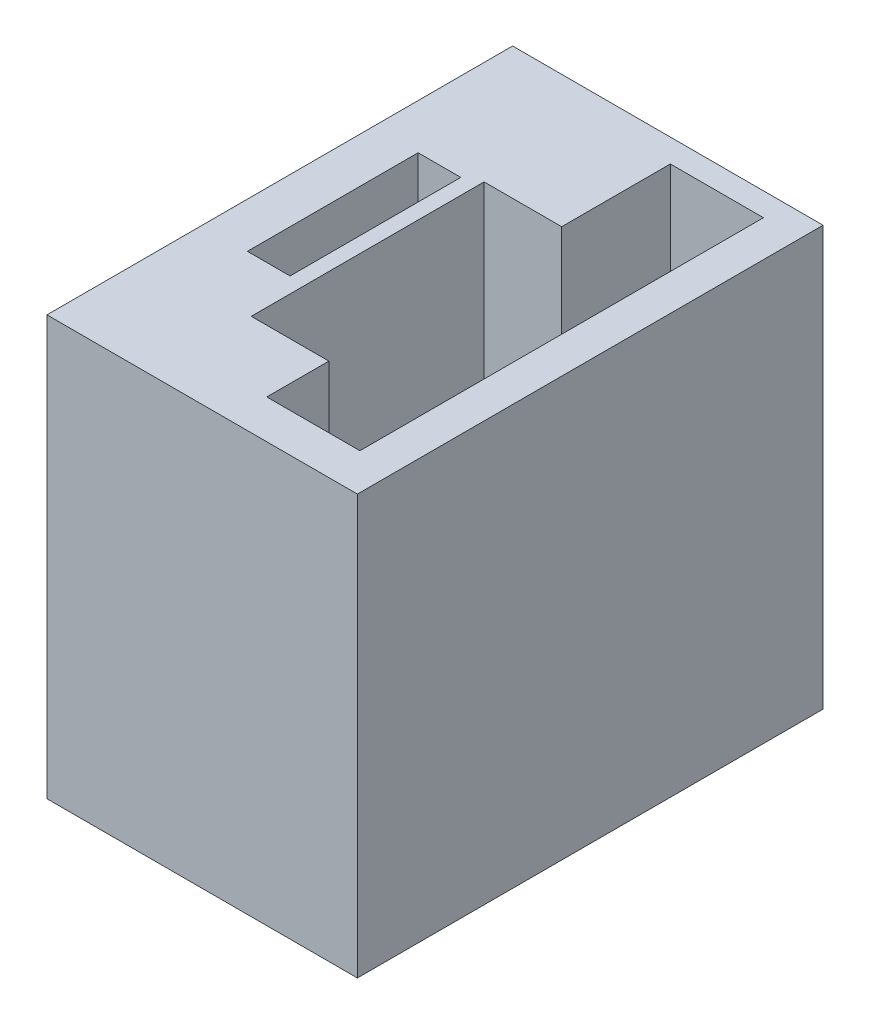
ISO-10303-21;
HEADER;
FILE_DESCRIPTION(('STEP AP214'),'2;1');
FILE_NAME('part.step','',(''),(''),'','','');
FILE_SCHEMA(('AUTOMOTIVE_DESIGN { 1 0 10303 214 1 1 1 1 }'));
ENDSEC;
DATA;
#1=APPLICATION_CONTEXT('core data for automotive mechanical design processes');
#2=APPLICATION_PROTOCOL_DEFINITION('international standard','automotive_design',2000,#1);
#3=PRODUCT_CONTEXT('',#1,'mechanical');
#4=PRODUCT('Part','Part','',(#3));
#5=PRODUCT_RELATED_PRODUCT_CATEGORY('part','',(#4));
#6=PRODUCT_DEFINITION_FORMATION('','',#4);
#7=PRODUCT_DEFINITION_CONTEXT('part definition',#1,'design');
#8=PRODUCT_DEFINITION('design','',#6,#7);
#9=PRODUCT_DEFINITION_SHAPE('','',#8);
#10=(LENGTH_UNIT() NAMED_UNIT(*) SI_UNIT(.MILLI.,.METRE.));
#11=(NAMED_UNIT(*) PLANE_ANGLE_UNIT() SI_UNIT($,.RADIAN.));
#12=(NAMED_UNIT(*) SI_UNIT($,.STERADIAN.) SOLID_ANGLE_UNIT());
#13=UNCERTAINTY_MEASURE_WITH_UNIT(LENGTH_MEASURE(1.E-05),#10,'distance_accuracy_value','');
#14=(GEOMETRIC_REPRESENTATION_CONTEXT(3) GLOBAL_UNCERTAINTY_ASSIGNED_CONTEXT((#13)) GLOBAL_UNIT_ASSIGNED_CONTEXT((#10,
#11,#12)) REPRESENTATION_CONTEXT('',''));
#15=CARTESIAN_POINT('',(0.,0.,0.));
#16=DIRECTION('',(0.,0.,1.));
#17=DIRECTION('',(1.,0.,0.));
#18=AXIS2_PLACEMENT_3D('',#15,#16,#17);
#19=CARTESIAN_POINT('',(0.,9.5,0.));
#20=DIRECTION('',(0.,1.,0.));
#21=DIRECTION('',(0.,0.,1.));
#22=AXIS2_PLACEMENT_3D('',#19,#20,#21);
#23=PLANE('',#22);
#24=DIRECTION('',(-1.,0.,0.));
#25=VECTOR('',#24,1.);
#26=CARTESIAN_POINT('',(6.5,9.5,-17.1015528128088));
#27=LINE('',#26,#25);
#28=CARTESIAN_POINT('',(5.66196126146727,9.5,-17.1015528128088));
#29=VERTEX_POINT('',#28);
#30=CARTESIAN_POINT('',(2.91196126146727,9.5,-17.1015528128088));
#31=VERTEX_POINT('',#30);
#32=EDGE_CURVE('E11',#29,#31,#27,.T.);
#33=ORIENTED_EDGE('',*,*,#32,.F.);
#34=DIRECTION('',(0.,0.,-1.));
#35=VECTOR('',#34,1.);
#36=CARTESIAN_POINT('',(5.66196126146727,9.5,-21.));
#37=LINE('',#36,#35);
#38=CARTESIAN_POINT('',(5.66196126146727,9.5,-21.));
#39=VERTEX_POINT('',#38);
#40=EDGE_CURVE('E173',#29,#39,#37,.T.);
#41=ORIENTED_EDGE('',*,*,#40,.T.);
#42=DIRECTION('',(-1.,0.,0.));
#43=VECTOR('',#42,1.);
#44=CARTESIAN_POINT('',(2.91196126146727,9.5,-21.));
#45=LINE('',#44,#43);
#46=CARTESIAN_POINT('',(2.91196126146727,9.5,-21.));
#47=VERTEX_POINT('',#46);
#48=EDGE_CURVE('E179',#39,#47,#45,.T.);
#49=ORIENTED_EDGE('',*,*,#48,.T.);
#50=DIRECTION('',(0.,0.,1.));
#51=VECTOR('',#50,1.);
#52=CARTESIAN_POINT('',(2.91196126146727,9.5,-21.));
#53=LINE('',#52,#51);
#54=EDGE_CURVE('E512',#47,#31,#53,.T.);
#55=ORIENTED_EDGE('',*,*,#54,.T.);
#56=EDGE_LOOP('',(#33,#41,#49,#55));
#57=FACE_BOUND('',#56,.T.);
#58=ADVANCED_FACE('F35',(#57),#23,.T.);
#59=CARTESIAN_POINT('',(20.,27.,0.));
#60=DIRECTION('',(0.,-1.,0.));
#61=DIRECTION('',(0.,0.,-1.));
#62=AXIS2_PLACEMENT_3D('',#59,#60,#61);
#63=PLANE('',#62);
#64=DIRECTION('',(1.,0.,0.));
#65=VECTOR('',#64,1.);
#66=CARTESIAN_POINT('',(2.91196126146727,27.,-9.99999999999999));
#67=LINE('',#66,#65);
#68=CARTESIAN_POINT('',(2.91196126146727,27.,-9.99999999999999));
#69=VERTEX_POINT('',#68);
#70=CARTESIAN_POINT('',(5.66196126146727,27.,-9.99999999999999));
#71=VERTEX_POINT('',#70);
#72=EDGE_CURVE('E188',#69,#71,#67,.T.);
#73=ORIENTED_EDGE('',*,*,#72,.F.);
#74=DIRECTION('',(0.,0.,1.));
#75=VECTOR('',#74,1.);
#76=CARTESIAN_POINT('',(2.91196126146727,27.,-21.));
#77=LINE('',#76,#75);
#78=CARTESIAN_POINT('',(2.91196126146727,27.,-21.));
#79=VERTEX_POINT('',#78);
#80=EDGE_CURVE('E57',#79,#69,#77,.T.);
#81=ORIENTED_EDGE('',*,*,#80,.F.);
#82=DIRECTION('',(-1.,0.,0.));
#83=VECTOR('',#82,1.);
#84=CARTESIAN_POINT('',(2.91196126146727,27.,-21.));
#85=LINE('',#84,#83);
#86=CARTESIAN_POINT('',(5.66196126146727,27.,-21.));
#87=VERTEX_POINT('',#86);
#88=EDGE_CURVE('E194',#87,#79,#85,.T.);
#89=ORIENTED_EDGE('',*,*,#88,.F.);
#90=DIRECTION('',(0.,0.,-1.));
#91=VECTOR('',#90,1.);
#92=CARTESIAN_POINT('',(5.66196126146727,27.,-21.));
#93=LINE('',#92,#91);
#94=EDGE_CURVE('E191',#71,#87,#93,.T.);
#95=ORIENTED_EDGE('',*,*,#94,.F.);
#96=EDGE_LOOP('',(#73,#81,#89,#95));
#97=FACE_BOUND('',#96,.T.);
#98=DIRECTION('',(0.,0.,1.));
#99=VECTOR('',#98,1.);
#100=CARTESIAN_POINT('',(0.,27.,0.));
#101=LINE('',#100,#99);
#102=CARTESIAN_POINT('',(0.,27.,-30.));
#103=VERTEX_POINT('',#102);
#104=CARTESIAN_POINT('',(0.,27.,0.));
#105=VERTEX_POINT('',#104);
#106=EDGE_CURVE('E278',#103,#105,#101,.T.);
#107=ORIENTED_EDGE('',*,*,#106,.T.);
#108=DIRECTION('',(-1.,0.,0.));
#109=VECTOR('',#108,1.);
#110=CARTESIAN_POINT('',(20.,27.,0.));
#111=LINE('',#110,#109);
#112=CARTESIAN_POINT('',(20.,27.,0.));
#113=VERTEX_POINT('',#112);
#114=EDGE_CURVE('E284',#113,#105,#111,.T.);
#115=ORIENTED_EDGE('',*,*,#114,.F.);
#116=DIRECTION('',(0.,0.,1.));
#117=VECTOR('',#116,1.);
#118=CARTESIAN_POINT('',(20.,27.,0.));
#119=LINE('',#118,#117);
#120=CARTESIAN_POINT('',(20.,27.,-30.));
#121=VERTEX_POINT('',#120);
#122=EDGE_CURVE('E282',#121,#113,#119,.T.);
#123=ORIENTED_EDGE('',*,*,#122,.F.);
#124=DIRECTION('',(-1.,0.,0.));
#125=VECTOR('',#124,1.);
#126=CARTESIAN_POINT('',(20.,27.,-30.));
#127=LINE('',#126,#125);
#128=EDGE_CURVE('E294',#121,#103,#127,.T.);
#129=ORIENTED_EDGE('',*,*,#128,.T.);
#130=EDGE_LOOP('',(#107,#115,#123,#129));
#131=FACE_BOUND('',#130,.T.);
#132=DIRECTION('',(0.,0.,1.));
#133=VECTOR('',#132,1.);
#134=CARTESIAN_POINT('',(6.66196126146727,27.,-21.5));
#135=LINE('',#134,#133);
#136=CARTESIAN_POINT('',(6.66196126146727,27.,-21.5));
#137=VERTEX_POINT('',#136);
#138=CARTESIAN_POINT('',(6.66196126146727,27.,-6.5));
#139=VERTEX_POINT('',#138);
#140=EDGE_CURVE('E209',#137,#139,#135,.T.);
#141=ORIENTED_EDGE('',*,*,#140,.F.);
#142=DIRECTION('',(-1.,0.,0.));
#143=VECTOR('',#142,1.);
#144=CARTESIAN_POINT('',(6.66196126146727,27.,-21.5));
#145=LINE('',#144,#143);
#146=CARTESIAN_POINT('',(11.6619612614673,27.,-21.5));
#147=VERTEX_POINT('',#146);
#148=EDGE_CURVE('E216',#147,#137,#145,.T.);
#149=ORIENTED_EDGE('',*,*,#148,.F.);
#150=DIRECTION('',(0.,0.,1.));
#151=VECTOR('',#150,1.);
#152=CARTESIAN_POINT('',(11.6619612614673,26.9999999999758,-28.5));
#153=LINE('',#152,#151);
#154=CARTESIAN_POINT('',(11.6619612614673,27.,-28.5));
#155=VERTEX_POINT('',#154);
#156=EDGE_CURVE('E243',#155,#147,#153,.T.);
#157=ORIENTED_EDGE('',*,*,#156,.F.);
#158=DIRECTION('',(1.,0.,0.));
#159=VECTOR('',#158,1.);
#160=CARTESIAN_POINT('',(11.6619612614673,26.9999999999758,-28.5));
#161=LINE('',#160,#159);
#162=CARTESIAN_POINT('',(17.6619612614673,26.9999999999758,-28.5));
#163=VERTEX_POINT('',#162);
#164=EDGE_CURVE('E232',#155,#163,#161,.T.);
#165=ORIENTED_EDGE('',*,*,#164,.T.);
#166=DIRECTION('',(0.,0.,1.));
#167=VECTOR('',#166,1.);
#168=CARTESIAN_POINT('',(17.6619612614673,26.9999999999758,-28.5));
#169=LINE('',#168,#167);
#170=CARTESIAN_POINT('',(17.6619612614673,26.9999999999758,-2.5));
#171=VERTEX_POINT('',#170);
#172=EDGE_CURVE('E254',#163,#171,#169,.T.);
#173=ORIENTED_EDGE('',*,*,#172,.T.);
#174=DIRECTION('',(1.,0.,0.));
#175=VECTOR('',#174,1.);
#176=CARTESIAN_POINT('',(11.6619612614673,26.9999999999758,-2.5));
#177=LINE('',#176,#175);
#178=CARTESIAN_POINT('',(11.6619612614673,26.9999999999758,-2.5));
#179=VERTEX_POINT('',#178);
#180=EDGE_CURVE('E257',#179,#171,#177,.T.);
#181=ORIENTED_EDGE('',*,*,#180,.F.);
#182=CARTESIAN_POINT('',(11.6619612614673,27.,-6.5));
#183=VERTEX_POINT('',#182);
#184=EDGE_CURVE('E260',#183,#179,#153,.T.);
#185=ORIENTED_EDGE('',*,*,#184,.F.);
#186=DIRECTION('',(1.,0.,0.));
#187=VECTOR('',#186,1.);
#188=CARTESIAN_POINT('',(6.66196126146727,27.,-6.5));
#189=LINE('',#188,#187);
#190=EDGE_CURVE('E226',#139,#183,#189,.T.);
#191=ORIENTED_EDGE('',*,*,#190,.F.);
#192=EDGE_LOOP('',(#141,#149,#157,#165,#173,#181,#185,#191));
#193=FACE_BOUND('',#192,.T.);
#194=ADVANCED_FACE('F319',(#97,#131,#193),#63,.F.);
#195=CARTESIAN_POINT('',(20.,0.,0.));
#196=DIRECTION('',(0.,0.,-1.));
#197=DIRECTION('',(0.,1.,0.));
#198=AXIS2_PLACEMENT_3D('',#195,#196,#197);
#199=PLANE('',#198);
#200=DIRECTION('',(0.,-1.,0.));
#201=VECTOR('',#200,1.);
#202=CARTESIAN_POINT('',(0.,0.,0.));
#203=LINE('',#202,#201);
#204=CARTESIAN_POINT('',(0.,0.,0.));
#205=VERTEX_POINT('',#204);
#206=EDGE_CURVE('E273',#105,#205,#203,.T.);
#207=ORIENTED_EDGE('',*,*,#206,.T.);
#208=DIRECTION('',(-1.,0.,0.));
#209=VECTOR('',#208,1.);
#210=CARTESIAN_POINT('',(20.,0.,0.));
#211=LINE('',#210,#209);
#212=CARTESIAN_POINT('',(20.,0.,0.));
#213=VERTEX_POINT('',#212);
#214=EDGE_CURVE('E165',#213,#205,#211,.T.);
#215=ORIENTED_EDGE('',*,*,#214,.F.);
#216=DIRECTION('',(0.,-1.,0.));
#217=VECTOR('',#216,1.);
#218=CARTESIAN_POINT('',(20.,0.,0.));
#219=LINE('',#218,#217);
#220=EDGE_CURVE('E274',#113,#213,#219,.T.);
#221=ORIENTED_EDGE('',*,*,#220,.F.);
#222=ORIENTED_EDGE('',*,*,#114,.T.);
#223=EDGE_LOOP('',(#207,#215,#221,#222));
#224=FACE_BOUND('',#223,.T.);
#225=ADVANCED_FACE('F37',(#224),#199,.F.);
#226=CARTESIAN_POINT('',(20.,0.,0.));
#227=DIRECTION('',(0.,1.,0.));
#228=DIRECTION('',(0.,0.,1.));
#229=AXIS2_PLACEMENT_3D('',#226,#227,#228);
#230=PLANE('',#229);
#231=DIRECTION('',(0.,0.,-1.));
#232=VECTOR('',#231,1.);
#233=CARTESIAN_POINT('',(0.,0.,0.));
#234=LINE('',#233,#232);
#235=CARTESIAN_POINT('',(0.,0.,-30.));
#236=VERTEX_POINT('',#235);
#237=EDGE_CURVE('E287',#205,#236,#234,.T.);
#238=ORIENTED_EDGE('',*,*,#237,.T.);
#239=DIRECTION('',(-1.,0.,0.));
#240=VECTOR('',#239,1.);
#241=CARTESIAN_POINT('',(20.,0.,-30.));
#242=LINE('',#241,#240);
#243=CARTESIAN_POINT('',(20.,0.,-30.));
#244=VERTEX_POINT('',#243);
#245=EDGE_CURVE('E297',#244,#236,#242,.T.);
#246=ORIENTED_EDGE('',*,*,#245,.F.);
#247=DIRECTION('',(0.,0.,-1.));
#248=VECTOR('',#247,1.);
#249=CARTESIAN_POINT('',(20.,0.,0.));
#250=LINE('',#249,#248);
#251=EDGE_CURVE('E277',#213,#244,#250,.T.);
#252=ORIENTED_EDGE('',*,*,#251,.F.);
#253=ORIENTED_EDGE('',*,*,#214,.T.);
#254=EDGE_LOOP('',(#238,#246,#252,#253));
#255=FACE_BOUND('',#254,.T.);
#256=ADVANCED_FACE('F303',(#255),#230,.F.);
#257=CARTESIAN_POINT('',(20.,0.,-30.));
#258=DIRECTION('',(0.,0.,1.));
#259=DIRECTION('',(1.,0.,0.));
#260=AXIS2_PLACEMENT_3D('',#257,#258,#259);
#261=PLANE('',#260);
#262=DIRECTION('',(0.,1.,0.));
#263=VECTOR('',#262,1.);
#264=CARTESIAN_POINT('',(0.,0.,-30.));
#265=LINE('',#264,#263);
#266=EDGE_CURVE('E289',#236,#103,#265,.T.);
#267=ORIENTED_EDGE('',*,*,#266,.T.);
#268=ORIENTED_EDGE('',*,*,#128,.F.);
#269=DIRECTION('',(0.,1.,0.));
#270=VECTOR('',#269,1.);
#271=CARTESIAN_POINT('',(20.,0.,-30.));
#272=LINE('',#271,#270);
#273=EDGE_CURVE('E280',#244,#121,#272,.T.);
#274=ORIENTED_EDGE('',*,*,#273,.F.);
#275=ORIENTED_EDGE('',*,*,#245,.T.);
#276=EDGE_LOOP('',(#267,#268,#274,#275));
#277=FACE_BOUND('',#276,.T.);
#278=ADVANCED_FACE('F315',(#277),#261,.F.);
#279=CARTESIAN_POINT('',(20.,0.,0.));
#280=DIRECTION('',(-1.,0.,0.));
#281=DIRECTION('',(0.,0.,1.));
#282=AXIS2_PLACEMENT_3D('',#279,#280,#281);
#283=PLANE('',#282);
#284=ORIENTED_EDGE('',*,*,#220,.T.);
#285=ORIENTED_EDGE('',*,*,#251,.T.);
#286=ORIENTED_EDGE('',*,*,#273,.T.);
#287=ORIENTED_EDGE('',*,*,#122,.T.);
#288=EDGE_LOOP('',(#284,#285,#286,#287));
#289=FACE_BOUND('',#288,.T.);
#290=ADVANCED_FACE('F322',(#289),#283,.F.);
#291=CARTESIAN_POINT('',(0.,0.,0.));
#292=DIRECTION('',(-1.,0.,0.));
#293=DIRECTION('',(0.,0.,1.));
#294=AXIS2_PLACEMENT_3D('',#291,#292,#293);
#295=PLANE('',#294);
#296=CARTESIAN_POINT('',(0.,13.5,-15.1));
#297=DIRECTION('',(-1.,0.,0.));
#298=DIRECTION('',(0.,0.,1.));
#299=AXIS2_PLACEMENT_3D('',#296,#297,#298);
#300=CIRCLE('',#299,5.);
#301=CARTESIAN_POINT('',(0.,13.5,-10.1));
#302=VERTEX_POINT('',#301);
#303=EDGE_CURVE('E200',#302,#302,#300,.T.);
#304=ORIENTED_EDGE('',*,*,#303,.F.);
#305=EDGE_LOOP('',(#304));
#306=FACE_BOUND('',#305,.T.);
#307=ORIENTED_EDGE('',*,*,#206,.F.);
#308=ORIENTED_EDGE('',*,*,#106,.F.);
#309=ORIENTED_EDGE('',*,*,#266,.F.);
#310=ORIENTED_EDGE('',*,*,#237,.F.);
#311=EDGE_LOOP('',(#307,#308,#309,#310));
#312=FACE_BOUND('',#311,.T.);
#313=ADVANCED_FACE('F311',(#306,#312),#295,.T.);
#314=CARTESIAN_POINT('',(11.6619612614673,0.999999999975808,-28.5));
#315=DIRECTION('',(0.,0.,1.));
#316=DIRECTION('',(1.,0.,0.));
#317=AXIS2_PLACEMENT_3D('',#314,#315,#316);
#318=PLANE('',#317);
#319=ORIENTED_EDGE('',*,*,#164,.F.);
#320=DIRECTION('',(0.,1.,0.));
#321=VECTOR('',#320,1.);
#322=CARTESIAN_POINT('',(11.6619612614673,0.999999999975808,-28.5));
#323=LINE('',#322,#321);
#324=CARTESIAN_POINT('',(11.6619612614673,0.999999999975808,-28.5));
#325=VERTEX_POINT('',#324);
#326=EDGE_CURVE('E251',#325,#155,#323,.T.);
#327=ORIENTED_EDGE('',*,*,#326,.F.);
#328=DIRECTION('',(1.,0.,0.));
#329=VECTOR('',#328,1.);
#330=CARTESIAN_POINT('',(11.6619612614673,0.999999999975808,-28.5));
#331=LINE('',#330,#329);
#332=CARTESIAN_POINT('',(17.6619612614673,0.999999999975808,-28.5));
#333=VERTEX_POINT('',#332);
#334=EDGE_CURVE('E239',#325,#333,#331,.T.);
#335=ORIENTED_EDGE('',*,*,#334,.T.);
#336=DIRECTION('',(0.,1.,0.));
#337=VECTOR('',#336,1.);
#338=CARTESIAN_POINT('',(17.6619612614673,0.999999999975808,-28.5));
#339=LINE('',#338,#337);
#340=EDGE_CURVE('E270',#333,#163,#339,.T.);
#341=ORIENTED_EDGE('',*,*,#340,.T.);
#342=EDGE_LOOP('',(#319,#327,#335,#341));
#343=FACE_BOUND('',#342,.T.);
#344=ADVANCED_FACE('F329',(#343),#318,.T.);
#345=CARTESIAN_POINT('',(17.6619612614673,0.999999999975808,-28.5));
#346=DIRECTION('',(-1.,0.,0.));
#347=DIRECTION('',(0.,0.,1.));
#348=AXIS2_PLACEMENT_3D('',#345,#346,#347);
#349=PLANE('',#348);
#350=ORIENTED_EDGE('',*,*,#172,.F.);
#351=ORIENTED_EDGE('',*,*,#340,.F.);
#352=DIRECTION('',(0.,0.,1.));
#353=VECTOR('',#352,1.);
#354=CARTESIAN_POINT('',(17.6619612614673,0.999999999975808,-28.5));
#355=LINE('',#354,#353);
#356=CARTESIAN_POINT('',(17.6619612614673,0.999999999975808,-2.5));
#357=VERTEX_POINT('',#356);
#358=EDGE_CURVE('E242',#333,#357,#355,.T.);
#359=ORIENTED_EDGE('',*,*,#358,.T.);
#360=DIRECTION('',(0.,1.,0.));
#361=VECTOR('',#360,1.);
#362=CARTESIAN_POINT('',(17.6619612614673,0.999999999975808,-2.5));
#363=LINE('',#362,#361);
#364=EDGE_CURVE('E268',#357,#171,#363,.T.);
#365=ORIENTED_EDGE('',*,*,#364,.T.);
#366=EDGE_LOOP('',(#350,#351,#359,#365));
#367=FACE_BOUND('',#366,.T.);
#368=ADVANCED_FACE('F397',(#367),#349,.T.);
#369=CARTESIAN_POINT('',(11.6619612614673,0.999999999975808,-2.5));
#370=DIRECTION('',(0.,0.,1.));
#371=DIRECTION('',(1.,0.,0.));
#372=AXIS2_PLACEMENT_3D('',#369,#370,#371);
#373=PLANE('',#372);
#374=ORIENTED_EDGE('',*,*,#180,.T.);
#375=ORIENTED_EDGE('',*,*,#364,.F.);
#376=DIRECTION('',(1.,0.,0.));
#377=VECTOR('',#376,1.);
#378=CARTESIAN_POINT('',(11.6619612614673,0.999999999975808,-2.5));
#379=LINE('',#378,#377);
#380=CARTESIAN_POINT('',(11.6619612614673,0.999999999975808,-2.5));
#381=VERTEX_POINT('',#380);
#382=EDGE_CURVE('E245',#381,#357,#379,.T.);
#383=ORIENTED_EDGE('',*,*,#382,.F.);
#384=DIRECTION('',(0.,1.,0.));
#385=VECTOR('',#384,1.);
#386=CARTESIAN_POINT('',(11.6619612614673,0.999999999975808,-2.5));
#387=LINE('',#386,#385);
#388=EDGE_CURVE('E265',#381,#179,#387,.T.);
#389=ORIENTED_EDGE('',*,*,#388,.T.);
#390=EDGE_LOOP('',(#374,#375,#383,#389));
#391=FACE_BOUND('',#390,.T.);
#392=ADVANCED_FACE('F393',(#391),#373,.F.);
#393=CARTESIAN_POINT('',(11.6619612614673,0.999999999975808,-28.5));
#394=DIRECTION('',(-1.,0.,0.));
#395=DIRECTION('',(0.,0.,1.));
#396=AXIS2_PLACEMENT_3D('',#393,#394,#395);
#397=PLANE('',#396);
#398=ORIENTED_EDGE('',*,*,#156,.T.);
#399=DIRECTION('',(0.,1.,0.));
#400=VECTOR('',#399,1.);
#401=CARTESIAN_POINT('',(11.6619612614673,6.,-21.5));
#402=LINE('',#401,#400);
#403=CARTESIAN_POINT('',(11.6619612614673,6.,-21.5));
#404=VERTEX_POINT('',#403);
#405=EDGE_CURVE('E233',#404,#147,#402,.T.);
#406=ORIENTED_EDGE('',*,*,#405,.F.);
#407=DIRECTION('',(0.,0.,-1.));
#408=VECTOR('',#407,1.);
#409=CARTESIAN_POINT('',(11.6619612614673,6.,-21.5));
#410=LINE('',#409,#408);
#411=CARTESIAN_POINT('',(11.6619612614673,6.,-6.5));
#412=VERTEX_POINT('',#411);
#413=EDGE_CURVE('E218',#412,#404,#410,.T.);
#414=ORIENTED_EDGE('',*,*,#413,.F.);
#415=DIRECTION('',(0.,1.,0.));
#416=VECTOR('',#415,1.);
#417=CARTESIAN_POINT('',(11.6619612614673,6.,-6.5));
#418=LINE('',#417,#416);
#419=EDGE_CURVE('E235',#412,#183,#418,.T.);
#420=ORIENTED_EDGE('',*,*,#419,.T.);
#421=ORIENTED_EDGE('',*,*,#184,.T.);
#422=ORIENTED_EDGE('',*,*,#388,.F.);
#423=DIRECTION('',(0.,0.,1.));
#424=VECTOR('',#423,1.);
#425=CARTESIAN_POINT('',(11.6619612614673,0.999999999975808,-28.5));
#426=LINE('',#425,#424);
#427=EDGE_CURVE('E248',#325,#381,#426,.T.);
#428=ORIENTED_EDGE('',*,*,#427,.F.);
#429=ORIENTED_EDGE('',*,*,#326,.T.);
#430=EDGE_LOOP('',(#398,#406,#414,#420,#421,#422,#428,#429));
#431=FACE_BOUND('',#430,.T.);
#432=ADVANCED_FACE('F389',(#431),#397,.F.);
#433=CARTESIAN_POINT('',(0.,0.999999999975808,0.));
#434=DIRECTION('',(0.,-1.,0.));
#435=DIRECTION('',(0.,0.,-1.));
#436=AXIS2_PLACEMENT_3D('',#433,#434,#435);
#437=PLANE('',#436);
#438=ORIENTED_EDGE('',*,*,#334,.F.);
#439=ORIENTED_EDGE('',*,*,#427,.T.);
#440=ORIENTED_EDGE('',*,*,#382,.T.);
#441=ORIENTED_EDGE('',*,*,#358,.F.);
#442=EDGE_LOOP('',(#438,#439,#440,#441));
#443=FACE_BOUND('',#442,.T.);
#444=ADVANCED_FACE('F385',(#443),#437,.F.);
#445=CARTESIAN_POINT('',(6.66196126146727,6.,-21.5));
#446=DIRECTION('',(-1.,0.,0.));
#447=DIRECTION('',(0.,0.,1.));
#448=AXIS2_PLACEMENT_3D('',#445,#446,#447);
#449=PLANE('',#448);
#450=ORIENTED_EDGE('',*,*,#140,.T.);
#451=DIRECTION('',(0.,1.,0.));
#452=VECTOR('',#451,1.);
#453=CARTESIAN_POINT('',(6.66196126146727,6.,-6.5));
#454=LINE('',#453,#452);
#455=CARTESIAN_POINT('',(6.66196126146727,6.,-6.5));
#456=VERTEX_POINT('',#455);
#457=EDGE_CURVE('E223',#456,#139,#454,.T.);
#458=ORIENTED_EDGE('',*,*,#457,.F.);
#459=DIRECTION('',(0.,0.,1.));
#460=VECTOR('',#459,1.);
#461=CARTESIAN_POINT('',(6.66196126146727,6.,-21.5));
#462=LINE('',#461,#460);
#463=CARTESIAN_POINT('',(6.66196126146727,6.,-21.5));
#464=VERTEX_POINT('',#463);
#465=EDGE_CURVE('E212',#464,#456,#462,.T.);
#466=ORIENTED_EDGE('',*,*,#465,.F.);
#467=DIRECTION('',(0.,1.,0.));
#468=VECTOR('',#467,1.);
#469=CARTESIAN_POINT('',(6.66196126146727,6.,-21.5));
#470=LINE('',#469,#468);
#471=EDGE_CURVE('E230',#464,#137,#470,.T.);
#472=ORIENTED_EDGE('',*,*,#471,.T.);
#473=EDGE_LOOP('',(#450,#458,#466,#472));
#474=FACE_BOUND('',#473,.T.);
#475=ADVANCED_FACE('F378',(#474),#449,.F.);
#476=CARTESIAN_POINT('',(6.66196126146727,6.,-21.5));
#477=DIRECTION('',(0.,0.,-1.));
#478=DIRECTION('',(-1.,0.,0.));
#479=AXIS2_PLACEMENT_3D('',#476,#477,#478);
#480=PLANE('',#479);
#481=ORIENTED_EDGE('',*,*,#148,.T.);
#482=ORIENTED_EDGE('',*,*,#471,.F.);
#483=DIRECTION('',(-1.,0.,0.));
#484=VECTOR('',#483,1.);
#485=CARTESIAN_POINT('',(6.66196126146727,6.,-21.5));
#486=LINE('',#485,#484);
#487=EDGE_CURVE('E220',#404,#464,#486,.T.);
#488=ORIENTED_EDGE('',*,*,#487,.F.);
#489=ORIENTED_EDGE('',*,*,#405,.T.);
#490=EDGE_LOOP('',(#481,#482,#488,#489));
#491=FACE_BOUND('',#490,.T.);
#492=ADVANCED_FACE('F375',(#491),#480,.F.);
#493=CARTESIAN_POINT('',(6.66196126146727,6.,-6.5));
#494=DIRECTION('',(0.,0.,1.));
#495=DIRECTION('',(1.,0.,0.));
#496=AXIS2_PLACEMENT_3D('',#493,#494,#495);
#497=PLANE('',#496);
#498=ORIENTED_EDGE('',*,*,#190,.T.);
#499=ORIENTED_EDGE('',*,*,#419,.F.);
#500=DIRECTION('',(1.,0.,0.));
#501=VECTOR('',#500,1.);
#502=CARTESIAN_POINT('',(6.66196126146727,6.,-6.5));
#503=LINE('',#502,#501);
#504=EDGE_CURVE('E215',#456,#412,#503,.T.);
#505=ORIENTED_EDGE('',*,*,#504,.F.);
#506=ORIENTED_EDGE('',*,*,#457,.T.);
#507=EDGE_LOOP('',(#498,#499,#505,#506));
#508=FACE_BOUND('',#507,.T.);
#509=ADVANCED_FACE('F373',(#508),#497,.F.);
#510=CARTESIAN_POINT('',(0.,6.,0.));
#511=DIRECTION('',(0.,1.,0.));
#512=DIRECTION('',(0.,0.,1.));
#513=AXIS2_PLACEMENT_3D('',#510,#511,#512);
#514=PLANE('',#513);
#515=ORIENTED_EDGE('',*,*,#465,.T.);
#516=ORIENTED_EDGE('',*,*,#504,.T.);
#517=ORIENTED_EDGE('',*,*,#413,.T.);
#518=ORIENTED_EDGE('',*,*,#487,.T.);
#519=EDGE_LOOP('',(#515,#516,#517,#518));
#520=FACE_BOUND('',#519,.T.);
#521=ADVANCED_FACE('F369',(#520),#514,.T.);
#522=CARTESIAN_POINT('',(0.5,13.5,-15.1));
#523=DIRECTION('',(-1.,0.,0.));
#524=DIRECTION('',(0.,0.,1.));
#525=AXIS2_PLACEMENT_3D('',#522,#523,#524);
#526=CYLINDRICAL_SURFACE('',#525,5.);
#527=CARTESIAN_POINT('',(0.5,13.5,-15.1));
#528=DIRECTION('',(-1.,0.,0.));
#529=DIRECTION('',(0.,0.,1.));
#530=AXIS2_PLACEMENT_3D('',#527,#528,#529);
#531=CIRCLE('',#530,5.);
#532=CARTESIAN_POINT('',(0.5,13.5,-10.1));
#533=VERTEX_POINT('',#532);
#534=EDGE_CURVE('E206',#533,#533,#531,.T.);
#535=ORIENTED_EDGE('',*,*,#534,.F.);
#536=EDGE_LOOP('',(#535));
#537=FACE_BOUND('',#536,.T.);
#538=ORIENTED_EDGE('',*,*,#303,.T.);
#539=EDGE_LOOP('',(#538));
#540=FACE_BOUND('',#539,.T.);
#541=ADVANCED_FACE('F365',(#537,#540),#526,.F.);
#542=CARTESIAN_POINT('',(0.5,13.5,-15.1));
#543=DIRECTION('',(-1.,0.,0.));
#544=DIRECTION('',(0.,0.,1.));
#545=AXIS2_PLACEMENT_3D('',#542,#543,#544);
#546=PLANE('',#545);
#547=CARTESIAN_POINT('',(0.5,13.5,-15.04));
#548=DIRECTION('',(-1.,0.,0.));
#549=DIRECTION('',(0.,0.,1.));
#550=AXIS2_PLACEMENT_3D('',#547,#548,#549);
#551=CIRCLE('',#550,4.5);
#552=CARTESIAN_POINT('',(0.5,13.5,-10.54));
#553=VERTEX_POINT('',#552);
#554=EDGE_CURVE('E507',#553,#553,#551,.T.);
#555=ORIENTED_EDGE('',*,*,#554,.F.);
#556=EDGE_LOOP('',(#555));
#557=FACE_BOUND('',#556,.T.);
#558=ORIENTED_EDGE('',*,*,#534,.T.);
#559=EDGE_LOOP('',(#558));
#560=FACE_BOUND('',#559,.T.);
#561=ADVANCED_FACE('F362',(#557,#560),#546,.T.);
#562=CARTESIAN_POINT('',(2.91196126146727,9.5,-21.));
#563=DIRECTION('',(-1.,0.,0.));
#564=DIRECTION('',(0.,0.,1.));
#565=AXIS2_PLACEMENT_3D('',#562,#563,#564);
#566=PLANE('',#565);
#567=CARTESIAN_POINT('',(2.91196126146727,9.5,-12.9784471871912));
#568=VERTEX_POINT('',#567);
#569=CARTESIAN_POINT('',(2.91196126146727,9.5,-9.99999999999999));
#570=VERTEX_POINT('',#569);
#571=EDGE_CURVE('E197',#568,#570,#53,.T.);
#572=ORIENTED_EDGE('',*,*,#571,.F.);
#573=CARTESIAN_POINT('',(2.91196126146727,13.5,-15.04));
#574=DIRECTION('',(-1.,0.,0.));
#575=DIRECTION('',(0.,0.,1.));
#576=AXIS2_PLACEMENT_3D('',#573,#574,#575);
#577=CIRCLE('',#576,4.5);
#578=EDGE_CURVE('E49',#568,#31,#577,.T.);
#579=ORIENTED_EDGE('',*,*,#578,.T.);
#580=ORIENTED_EDGE('',*,*,#54,.F.);
#581=DIRECTION('',(0.,1.,0.));
#582=VECTOR('',#581,1.);
#583=CARTESIAN_POINT('',(2.91196126146727,9.5,-21.));
#584=LINE('',#583,#582);
#585=EDGE_CURVE('E198',#47,#79,#584,.T.);
#586=ORIENTED_EDGE('',*,*,#585,.T.);
#587=ORIENTED_EDGE('',*,*,#80,.T.);
#588=DIRECTION('',(0.,1.,0.));
#589=VECTOR('',#588,1.);
#590=CARTESIAN_POINT('',(2.91196126146727,9.5,-9.99999999999999));
#591=LINE('',#590,#589);
#592=EDGE_CURVE('E182',#570,#69,#591,.T.);
#593=ORIENTED_EDGE('',*,*,#592,.F.);
#594=EDGE_LOOP('',(#572,#579,#580,#586,#587,#593));
#595=FACE_BOUND('',#594,.T.);
#596=ADVANCED_FACE('F359',(#595),#566,.F.);
#597=CARTESIAN_POINT('',(2.91196126146727,9.5,-21.));
#598=DIRECTION('',(0.,0.,-1.));
#599=DIRECTION('',(-1.,0.,0.));
#600=AXIS2_PLACEMENT_3D('',#597,#598,#599);
#601=PLANE('',#600);
#602=ORIENTED_EDGE('',*,*,#88,.T.);
#603=ORIENTED_EDGE('',*,*,#585,.F.);
#604=ORIENTED_EDGE('',*,*,#48,.F.);
#605=DIRECTION('',(0.,1.,0.));
#606=VECTOR('',#605,1.);
#607=CARTESIAN_POINT('',(5.66196126146727,9.5,-21.));
#608=LINE('',#607,#606);
#609=EDGE_CURVE('E201',#39,#87,#608,.T.);
#610=ORIENTED_EDGE('',*,*,#609,.T.);
#611=EDGE_LOOP('',(#602,#603,#604,#610));
#612=FACE_BOUND('',#611,.T.);
#613=ADVANCED_FACE('F356',(#612),#601,.F.);
#614=CARTESIAN_POINT('',(5.66196126146727,9.5,-21.));
#615=DIRECTION('',(1.,0.,0.));
#616=DIRECTION('',(0.,0.,-1.));
#617=AXIS2_PLACEMENT_3D('',#614,#615,#616);
#618=PLANE('',#617);
#619=ORIENTED_EDGE('',*,*,#40,.F.);
#620=CARTESIAN_POINT('',(5.66196126146727,13.5,-15.04));
#621=DIRECTION('',(1.,0.,0.));
#622=DIRECTION('',(0.,0.,-1.));
#623=AXIS2_PLACEMENT_3D('',#620,#621,#622);
#624=CIRCLE('',#623,4.5);
#625=CARTESIAN_POINT('',(5.66196126146727,9.5,-12.9784471871912));
#626=VERTEX_POINT('',#625);
#627=EDGE_CURVE('E160',#29,#626,#624,.T.);
#628=ORIENTED_EDGE('',*,*,#627,.T.);
#629=CARTESIAN_POINT('',(5.66196126146727,9.5,-9.99999999999999));
#630=VERTEX_POINT('',#629);
#631=EDGE_CURVE('E170',#630,#626,#37,.T.);
#632=ORIENTED_EDGE('',*,*,#631,.F.);
#633=DIRECTION('',(0.,1.,0.));
#634=VECTOR('',#633,1.);
#635=CARTESIAN_POINT('',(5.66196126146727,9.5,-9.99999999999999));
#636=LINE('',#635,#634);
#637=EDGE_CURVE('E203',#630,#71,#636,.T.);
#638=ORIENTED_EDGE('',*,*,#637,.T.);
#639=ORIENTED_EDGE('',*,*,#94,.T.);
#640=ORIENTED_EDGE('',*,*,#609,.F.);
#641=EDGE_LOOP('',(#619,#628,#632,#638,#639,#640));
#642=FACE_BOUND('',#641,.T.);
#643=ADVANCED_FACE('F169',(#642),#618,.F.);
#644=CARTESIAN_POINT('',(2.91196126146727,9.5,-9.99999999999999));
#645=DIRECTION('',(0.,0.,1.));
#646=DIRECTION('',(1.,0.,0.));
#647=AXIS2_PLACEMENT_3D('',#644,#645,#646);
#648=PLANE('',#647);
#649=ORIENTED_EDGE('',*,*,#72,.T.);
#650=ORIENTED_EDGE('',*,*,#637,.F.);
#651=DIRECTION('',(1.,0.,0.));
#652=VECTOR('',#651,1.);
#653=CARTESIAN_POINT('',(2.91196126146727,9.5,-9.99999999999999));
#654=LINE('',#653,#652);
#655=EDGE_CURVE('E178',#570,#630,#654,.T.);
#656=ORIENTED_EDGE('',*,*,#655,.F.);
#657=ORIENTED_EDGE('',*,*,#592,.T.);
#658=EDGE_LOOP('',(#649,#650,#656,#657));
#659=FACE_BOUND('',#658,.T.);
#660=ADVANCED_FACE('F345',(#659),#648,.F.);
#661=DIRECTION('',(-1.,0.,0.));
#662=VECTOR('',#661,1.);
#663=CARTESIAN_POINT('',(6.5,9.5,-12.9784471871912));
#664=LINE('',#663,#662);
#665=EDGE_CURVE('E43',#568,#626,#664,.F.);
#666=ORIENTED_EDGE('',*,*,#665,.F.);
#667=ORIENTED_EDGE('',*,*,#571,.T.);
#668=ORIENTED_EDGE('',*,*,#655,.T.);
#669=ORIENTED_EDGE('',*,*,#631,.T.);
#670=EDGE_LOOP('',(#666,#667,#668,#669));
#671=FACE_BOUND('',#670,.T.);
#672=ADVANCED_FACE('F176',(#671),#23,.T.);
#673=CARTESIAN_POINT('',(6.5,13.5,-15.04));
#674=DIRECTION('',(-1.,0.,0.));
#675=DIRECTION('',(0.,0.,1.));
#676=AXIS2_PLACEMENT_3D('',#673,#674,#675);
#677=CYLINDRICAL_SURFACE('',#676,4.5);
#678=ORIENTED_EDGE('',*,*,#32,.T.);
#679=ORIENTED_EDGE('',*,*,#578,.F.);
#680=ORIENTED_EDGE('',*,*,#665,.T.);
#681=ORIENTED_EDGE('',*,*,#627,.F.);
#682=EDGE_LOOP('',(#678,#679,#680,#681));
#683=FACE_BOUND('',#682,.T.);
#684=CARTESIAN_POINT('',(6.5,13.5,-15.04));
#685=DIRECTION('',(-1.,0.,0.));
#686=DIRECTION('',(0.,0.,1.));
#687=AXIS2_PLACEMENT_3D('',#684,#685,#686);
#688=CIRCLE('',#687,4.5);
#689=CARTESIAN_POINT('',(6.5,13.5,-10.54));
#690=VERTEX_POINT('',#689);
#691=EDGE_CURVE('E174',#690,#690,#688,.T.);
#692=ORIENTED_EDGE('',*,*,#691,.F.);
#693=EDGE_LOOP('',(#692));
#694=FACE_BOUND('',#693,.T.);
#695=ORIENTED_EDGE('',*,*,#554,.T.);
#696=EDGE_LOOP('',(#695));
#697=FACE_BOUND('',#696,.T.);
#698=ADVANCED_FACE('F158',(#683,#694,#697),#677,.F.);
#699=CARTESIAN_POINT('',(6.5,13.5,-15.04));
#700=DIRECTION('',(-1.,0.,0.));
#701=DIRECTION('',(0.,0.,1.));
#702=AXIS2_PLACEMENT_3D('',#699,#700,#701);
#703=PLANE('',#702);
#704=ORIENTED_EDGE('',*,*,#691,.T.);
#705=EDGE_LOOP('',(#704));
#706=FACE_BOUND('',#705,.T.);
#707=ADVANCED_FACE('F350',(#706),#703,.T.);
#708=CLOSED_SHELL('',(#58,#194,#225,#256,#278,#290,#313,#344,#368,#392,#432,#444,#475,#492,#509,
#521,#541,#561,#596,#613,#643,#660,#672,#698,#707));
#709=MANIFOLD_SOLID_BREP('B2',#708);
#710=ADVANCED_BREP_SHAPE_REPRESENTATION('',(#18,#709),#14);
#711=SHAPE_DEFINITION_REPRESENTATION(#9,#710);
ENDSEC;
END-ISO-10303-21;
